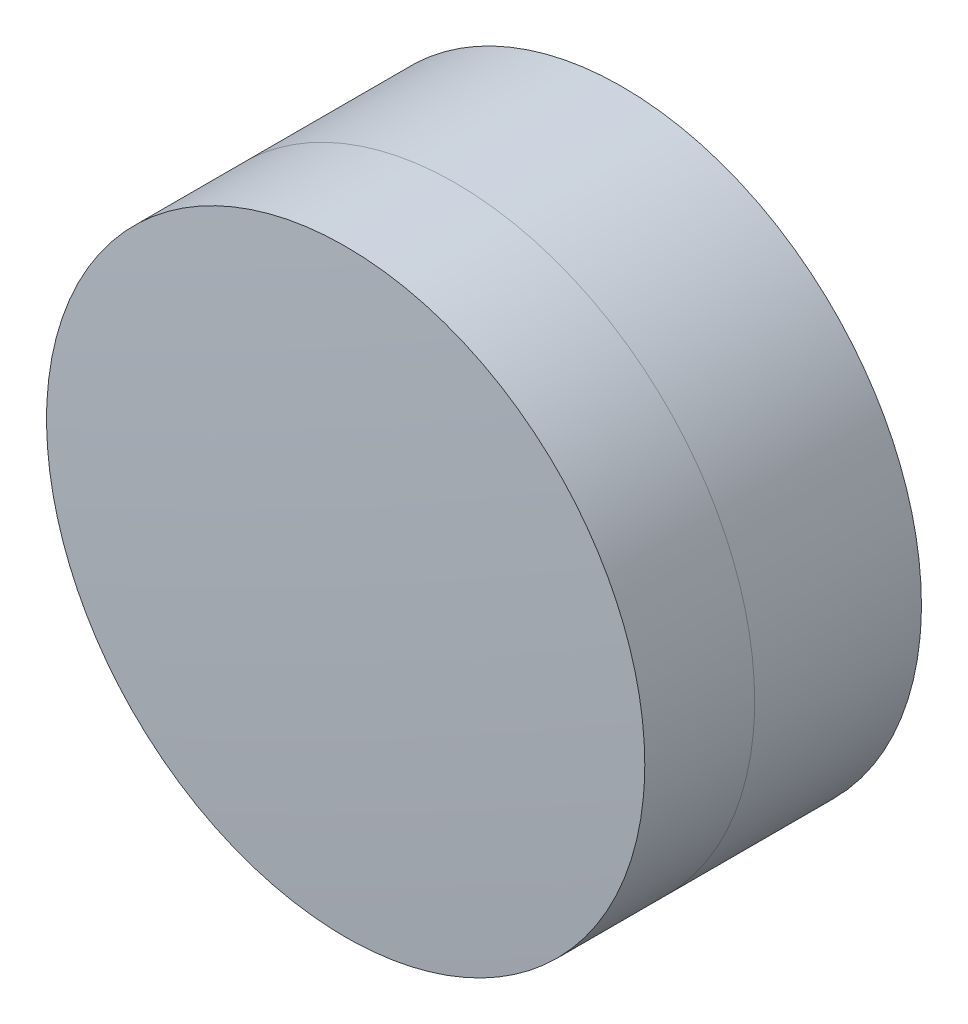
ISO-10303-21;
HEADER;
FILE_DESCRIPTION(('STEP AP214'),'2;1');
FILE_NAME('part.step','',(''),(''),'','','');
FILE_SCHEMA(('AUTOMOTIVE_DESIGN { 1 0 10303 214 1 1 1 1 }'));
ENDSEC;
DATA;
#1=APPLICATION_CONTEXT('core data for automotive mechanical design processes');
#2=APPLICATION_PROTOCOL_DEFINITION('international standard','automotive_design',2000,#1);
#3=PRODUCT_CONTEXT('',#1,'mechanical');
#4=PRODUCT('Part','Part','',(#3));
#5=PRODUCT_RELATED_PRODUCT_CATEGORY('part','',(#4));
#6=PRODUCT_DEFINITION_FORMATION('','',#4);
#7=PRODUCT_DEFINITION_CONTEXT('part definition',#1,'design');
#8=PRODUCT_DEFINITION('design','',#6,#7);
#9=PRODUCT_DEFINITION_SHAPE('','',#8);
#10=(LENGTH_UNIT() NAMED_UNIT(*) SI_UNIT(.MILLI.,.METRE.));
#11=(NAMED_UNIT(*) PLANE_ANGLE_UNIT() SI_UNIT($,.RADIAN.));
#12=(NAMED_UNIT(*) SI_UNIT($,.STERADIAN.) SOLID_ANGLE_UNIT());
#13=UNCERTAINTY_MEASURE_WITH_UNIT(LENGTH_MEASURE(1.E-05),#10,'distance_accuracy_value','');
#14=(GEOMETRIC_REPRESENTATION_CONTEXT(3) GLOBAL_UNCERTAINTY_ASSIGNED_CONTEXT((#13)) GLOBAL_UNIT_ASSIGNED_CONTEXT((#10,
#11,#12)) REPRESENTATION_CONTEXT('',''));
#15=CARTESIAN_POINT('',(0.,0.,0.));
#16=DIRECTION('',(0.,0.,1.));
#17=DIRECTION('',(1.,0.,0.));
#18=AXIS2_PLACEMENT_3D('',#15,#16,#17);
#19=CARTESIAN_POINT('',(0.,0.,124.12));
#20=DIRECTION('',(1.,0.,0.));
#21=DIRECTION('',(0.,-1.,0.));
#22=AXIS2_PLACEMENT_3D('',#19,#20,#21);
#23=SPHERICAL_SURFACE('',#22,124.12);
#24=CARTESIAN_POINT('',(12.5,0.,0.631035310842449));
#25=CARTESIAN_POINT('',(12.5,12.5,0.631035310842449));
#26=CARTESIAN_POINT('',(0.,12.5,0.631035310842449));
#27=CARTESIAN_POINT('',(-12.5,12.5,0.631035310842449));
#28=CARTESIAN_POINT('',(-12.5,0.,0.631035310842449));
#29=CARTESIAN_POINT('',(-12.5,-12.5,0.631035310842449));
#30=CARTESIAN_POINT('',(0.,-12.5,0.631035310842449));
#31=CARTESIAN_POINT('',(12.5,-12.5,0.631035310842449));
#32=CARTESIAN_POINT('',(12.5,0.,0.631035310842449));
#33=(BOUNDED_CURVE() B_SPLINE_CURVE(2,(#24,#25,#26,#27,#28,#29,#30,#31,#32),.UNSPECIFIED.,.T.,
.F.) B_SPLINE_CURVE_WITH_KNOTS((3,2,2,2,3),(0.,1.5707963267949,3.14159265358979,
4.71238898038469,6.28318530717959),
.UNSPECIFIED.) CURVE() GEOMETRIC_REPRESENTATION_ITEM() RATIONAL_B_SPLINE_CURVE((1.,
0.707106781186548,1.,0.707106781186548,1.,0.707106781186548,1.,0.707106781186548,1.)) REPRESENTATION_ITEM(''));
#34=CARTESIAN_POINT('',(12.5,0.,0.631035310842449));
#35=VERTEX_POINT('',#34);
#36=EDGE_CURVE('P0_E28',#35,#35,#33,.T.);
#37=ORIENTED_EDGE('',*,*,#36,.F.);
#38=EDGE_LOOP('',(#37));
#39=FACE_BOUND('',#38,.T.);
#40=ADVANCED_FACE('P0_F16',(#39),#23,.T.);
#41=CARTESIAN_POINT('',(0.,0.,-78.76));
#42=DIRECTION('',(-1.,0.,0.));
#43=DIRECTION('',(0.,-1.,0.));
#44=AXIS2_PLACEMENT_3D('',#41,#42,#43);
#45=SPHERICAL_SURFACE('',#44,87.26);
#46=CARTESIAN_POINT('',(12.5,0.,7.60004631772728));
#47=CARTESIAN_POINT('',(12.5,12.5,7.60004631772728));
#48=CARTESIAN_POINT('',(0.,12.5,7.60004631772728));
#49=CARTESIAN_POINT('',(-12.5,12.5,7.60004631772728));
#50=CARTESIAN_POINT('',(-12.5,0.,7.60004631772728));
#51=CARTESIAN_POINT('',(-12.5,-12.5,7.60004631772728));
#52=CARTESIAN_POINT('',(0.,-12.5,7.60004631772728));
#53=CARTESIAN_POINT('',(12.5,-12.5,7.60004631772728));
#54=CARTESIAN_POINT('',(12.5,0.,7.60004631772728));
#55=(BOUNDED_CURVE() B_SPLINE_CURVE(2,(#46,#47,#48,#49,#50,#51,#52,#53,#54),.UNSPECIFIED.,.T.,
.F.) B_SPLINE_CURVE_WITH_KNOTS((3,2,2,2,3),(0.,1.5707963267949,3.14159265358979,
4.71238898038469,6.28318530717959),
.UNSPECIFIED.) CURVE() GEOMETRIC_REPRESENTATION_ITEM() RATIONAL_B_SPLINE_CURVE((1.,
0.707106781186548,1.,0.707106781186548,1.,0.707106781186548,1.,0.707106781186548,1.)) REPRESENTATION_ITEM(''));
#56=CARTESIAN_POINT('',(12.5,0.,7.60004631772728));
#57=VERTEX_POINT('',#56);
#58=EDGE_CURVE('P0_E11',#57,#57,#55,.T.);
#59=ORIENTED_EDGE('',*,*,#58,.T.);
#60=EDGE_LOOP('',(#59));
#61=FACE_BOUND('',#60,.T.);
#62=ADVANCED_FACE('P0_F18',(#61),#45,.T.);
#63=CARTESIAN_POINT('',(0.,0.,0.631035310842449));
#64=DIRECTION('',(0.,0.,1.));
#65=DIRECTION('',(1.,0.,0.));
#66=AXIS2_PLACEMENT_3D('',#63,#64,#65);
#67=CYLINDRICAL_SURFACE('',#66,12.5);
#68=ORIENTED_EDGE('',*,*,#58,.F.);
#69=CARTESIAN_POINT('',(12.5,0.,0.631035310842449));
#70=CARTESIAN_POINT('',(12.5,0.,7.60004631772728));
#71=(BOUNDED_CURVE() B_SPLINE_CURVE(1,(#69,#70),.UNSPECIFIED.,.F.,
.F.) B_SPLINE_CURVE_WITH_KNOTS((2,2),(0.,1.),
.UNSPECIFIED.) CURVE() GEOMETRIC_REPRESENTATION_ITEM() RATIONAL_B_SPLINE_CURVE((1.,1.)) REPRESENTATION_ITEM(''));
#72=EDGE_CURVE('P0_E44',#35,#57,#71,.T.);
#73=ORIENTED_EDGE('',*,*,#72,.F.);
#74=ORIENTED_EDGE('',*,*,#36,.T.);
#75=ORIENTED_EDGE('',*,*,#72,.T.);
#76=EDGE_LOOP('',(#68,#73,#74,#75));
#77=FACE_BOUND('',#76,.T.);
#78=ADVANCED_FACE('P0_F43',(#77),#67,.T.);
#79=CLOSED_SHELL('',(#40,#62,#78));
#80=MANIFOLD_SOLID_BREP('P0_B1',#79);
#81=CARTESIAN_POINT('',(0.,0.,-78.76));
#82=DIRECTION('',(1.,0.,0.));
#83=DIRECTION('',(0.,1.,0.));
#84=AXIS2_PLACEMENT_3D('',#81,#82,#83);
#85=SPHERICAL_SURFACE('',#84,87.26);
#86=CARTESIAN_POINT('',(12.5,0.,7.60004631772728));
#87=CARTESIAN_POINT('',(12.5,12.5,7.60004631772728));
#88=CARTESIAN_POINT('',(0.,12.5,7.60004631772728));
#89=CARTESIAN_POINT('',(-12.5,12.5,7.60004631772728));
#90=CARTESIAN_POINT('',(-12.5,0.,7.60004631772728));
#91=CARTESIAN_POINT('',(-12.5,-12.5,7.60004631772728));
#92=CARTESIAN_POINT('',(0.,-12.5,7.60004631772728));
#93=CARTESIAN_POINT('',(12.5,-12.5,7.60004631772728));
#94=CARTESIAN_POINT('',(12.5,0.,7.60004631772728));
#95=(BOUNDED_CURVE() B_SPLINE_CURVE(2,(#86,#87,#88,#89,#90,#91,#92,#93,#94),.UNSPECIFIED.,.T.,
.F.) B_SPLINE_CURVE_WITH_KNOTS((3,2,2,2,3),(0.,1.5707963267949,3.14159265358979,
4.71238898038469,6.28318530717959),
.UNSPECIFIED.) CURVE() GEOMETRIC_REPRESENTATION_ITEM() RATIONAL_B_SPLINE_CURVE((1.,
0.707106781186548,1.,0.707106781186548,1.,0.707106781186548,1.,0.707106781186548,1.)) REPRESENTATION_ITEM(''));
#96=CARTESIAN_POINT('',(12.5,0.,7.60004631772728));
#97=VERTEX_POINT('',#96);
#98=EDGE_CURVE('P1_E28',#97,#97,#95,.T.);
#99=ORIENTED_EDGE('',*,*,#98,.F.);
#100=EDGE_LOOP('',(#99));
#101=FACE_BOUND('',#100,.T.);
#102=ADVANCED_FACE('P1_F16',(#101),#85,.F.);
#103=CARTESIAN_POINT('',(0.,0.,-240.6));
#104=DIRECTION('',(-1.,0.,0.));
#105=DIRECTION('',(0.,-1.,0.));
#106=AXIS2_PLACEMENT_3D('',#103,#104,#105);
#107=SPHERICAL_SURFACE('',#106,253.1);
#108=CARTESIAN_POINT('',(12.5,0.,12.191139085214));
#109=CARTESIAN_POINT('',(12.5,12.5,12.191139085214));
#110=CARTESIAN_POINT('',(0.,12.5,12.191139085214));
#111=CARTESIAN_POINT('',(-12.5,12.5,12.191139085214));
#112=CARTESIAN_POINT('',(-12.5,0.,12.191139085214));
#113=CARTESIAN_POINT('',(-12.5,-12.5,12.191139085214));
#114=CARTESIAN_POINT('',(0.,-12.5,12.191139085214));
#115=CARTESIAN_POINT('',(12.5,-12.5,12.191139085214));
#116=CARTESIAN_POINT('',(12.5,0.,12.191139085214));
#117=(BOUNDED_CURVE() B_SPLINE_CURVE(2,(#108,#109,#110,#111,#112,#113,#114,#115,#116),
.UNSPECIFIED.,.T.,.F.) B_SPLINE_CURVE_WITH_KNOTS((3,2,2,2,3),(0.,1.5707963267949,
3.14159265358979,4.71238898038469,6.28318530717959),
.UNSPECIFIED.) CURVE() GEOMETRIC_REPRESENTATION_ITEM() RATIONAL_B_SPLINE_CURVE((1.,
0.707106781186548,1.,0.707106781186548,1.,0.707106781186548,1.,0.707106781186548,1.)) REPRESENTATION_ITEM(''));
#118=CARTESIAN_POINT('',(12.5,0.,12.191139085214));
#119=VERTEX_POINT('',#118);
#120=EDGE_CURVE('P1_E11',#119,#119,#117,.T.);
#121=ORIENTED_EDGE('',*,*,#120,.T.);
#122=EDGE_LOOP('',(#121));
#123=FACE_BOUND('',#122,.T.);
#124=ADVANCED_FACE('P1_F45',(#123),#107,.T.);
#125=CARTESIAN_POINT('',(0.,0.,7.60004631772728));
#126=DIRECTION('',(0.,0.,1.));
#127=DIRECTION('',(1.,0.,0.));
#128=AXIS2_PLACEMENT_3D('',#125,#126,#127);
#129=CYLINDRICAL_SURFACE('',#128,12.5);
#130=ORIENTED_EDGE('',*,*,#120,.F.);
#131=CARTESIAN_POINT('',(12.5,0.,7.60004631772728));
#132=CARTESIAN_POINT('',(12.5,0.,12.191139085214));
#133=(BOUNDED_CURVE() B_SPLINE_CURVE(1,(#131,#132),.UNSPECIFIED.,.F.,
.F.) B_SPLINE_CURVE_WITH_KNOTS((2,2),(0.,1.),
.UNSPECIFIED.) CURVE() GEOMETRIC_REPRESENTATION_ITEM() RATIONAL_B_SPLINE_CURVE((1.,1.)) REPRESENTATION_ITEM(''));
#134=EDGE_CURVE('P1_E19',#97,#119,#133,.T.);
#135=ORIENTED_EDGE('',*,*,#134,.F.);
#136=ORIENTED_EDGE('',*,*,#98,.T.);
#137=ORIENTED_EDGE('',*,*,#134,.T.);
#138=EDGE_LOOP('',(#130,#135,#136,#137));
#139=FACE_BOUND('',#138,.T.);
#140=ADVANCED_FACE('P1_F43',(#139),#129,.T.);
#141=CLOSED_SHELL('',(#102,#124,#140));
#142=MANIFOLD_SOLID_BREP('P1_B1',#141);
#143=ADVANCED_BREP_SHAPE_REPRESENTATION('',(#18,#80,#142),#14);
#144=SHAPE_DEFINITION_REPRESENTATION(#9,#143);
ENDSEC;
END-ISO-10303-21;
